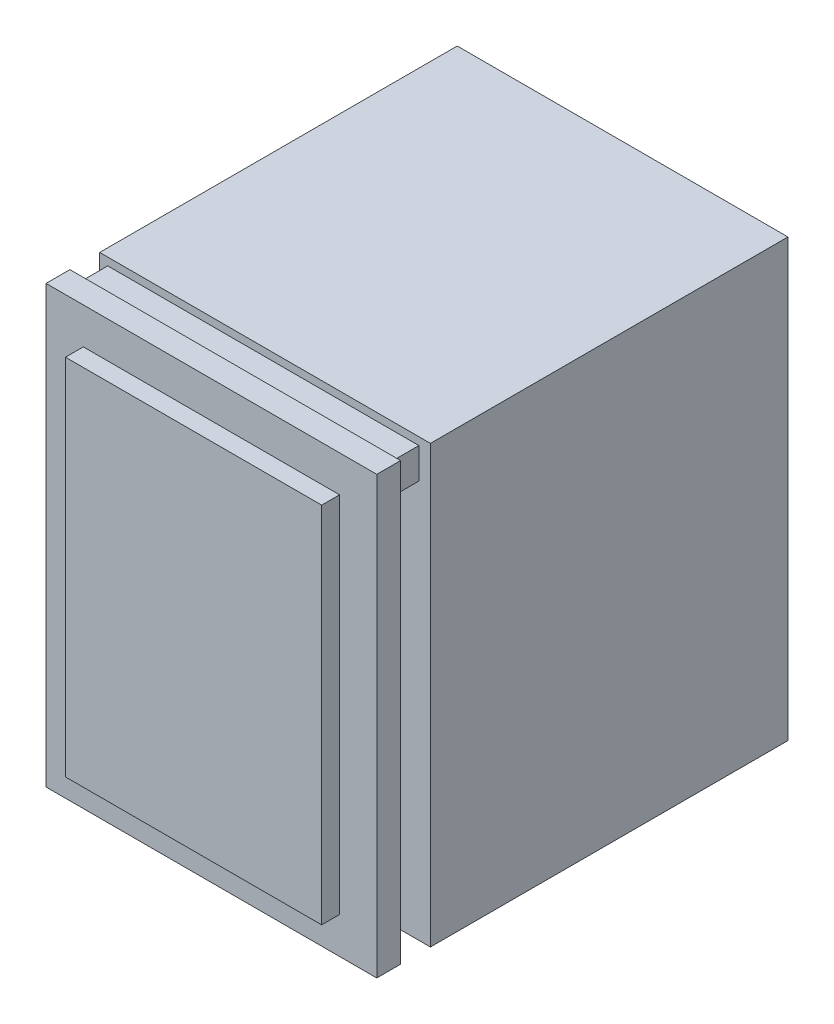
ISO-10303-21;
HEADER;
FILE_DESCRIPTION(('STEP AP214'),'2;1');
FILE_NAME('part.step','',(''),(''),'','','');
FILE_SCHEMA(('AUTOMOTIVE_DESIGN { 1 0 10303 214 1 1 1 1 }'));
ENDSEC;
DATA;
#1=APPLICATION_CONTEXT('core data for automotive mechanical design processes');
#2=APPLICATION_PROTOCOL_DEFINITION('international standard','automotive_design',2000,#1);
#3=PRODUCT_CONTEXT('',#1,'mechanical');
#4=PRODUCT('Part','Part','',(#3));
#5=PRODUCT_RELATED_PRODUCT_CATEGORY('part','',(#4));
#6=PRODUCT_DEFINITION_FORMATION('','',#4);
#7=PRODUCT_DEFINITION_CONTEXT('part definition',#1,'design');
#8=PRODUCT_DEFINITION('design','',#6,#7);
#9=PRODUCT_DEFINITION_SHAPE('','',#8);
#10=(LENGTH_UNIT() NAMED_UNIT(*) SI_UNIT(.MILLI.,.METRE.));
#11=(NAMED_UNIT(*) PLANE_ANGLE_UNIT() SI_UNIT($,.RADIAN.));
#12=(NAMED_UNIT(*) SI_UNIT($,.STERADIAN.) SOLID_ANGLE_UNIT());
#13=UNCERTAINTY_MEASURE_WITH_UNIT(LENGTH_MEASURE(1.E-05),#10,'distance_accuracy_value','');
#14=(GEOMETRIC_REPRESENTATION_CONTEXT(3) GLOBAL_UNCERTAINTY_ASSIGNED_CONTEXT((#13)) GLOBAL_UNIT_ASSIGNED_CONTEXT((#10,
#11,#12)) REPRESENTATION_CONTEXT('',''));
#15=CARTESIAN_POINT('',(0.,0.,0.));
#16=DIRECTION('',(0.,0.,1.));
#17=DIRECTION('',(1.,0.,0.));
#18=AXIS2_PLACEMENT_3D('',#15,#16,#17);
#19=CARTESIAN_POINT('',(0.,0.,4.));
#20=DIRECTION('',(0.,0.,-1.));
#21=DIRECTION('',(-1.,0.,0.));
#22=AXIS2_PLACEMENT_3D('',#19,#20,#21);
#23=PLANE('',#22);
#24=DIRECTION('',(0.,-1.,0.));
#25=VECTOR('',#24,1.);
#26=CARTESIAN_POINT('',(-27.75,36.6,4.));
#27=LINE('',#26,#25);
#28=CARTESIAN_POINT('',(-27.75,36.6,4.));
#29=VERTEX_POINT('',#28);
#30=CARTESIAN_POINT('',(-27.75,-36.6,4.));
#31=VERTEX_POINT('',#30);
#32=EDGE_CURVE('E235',#29,#31,#27,.T.);
#33=ORIENTED_EDGE('',*,*,#32,.T.);
#34=DIRECTION('',(1.,0.,0.));
#35=VECTOR('',#34,1.);
#36=CARTESIAN_POINT('',(27.75,-36.6,4.));
#37=LINE('',#36,#35);
#38=CARTESIAN_POINT('',(27.75,-36.6,4.));
#39=VERTEX_POINT('',#38);
#40=EDGE_CURVE('E238',#31,#39,#37,.T.);
#41=ORIENTED_EDGE('',*,*,#40,.T.);
#42=DIRECTION('',(0.,1.,0.));
#43=VECTOR('',#42,1.);
#44=CARTESIAN_POINT('',(27.75,36.6,4.));
#45=LINE('',#44,#43);
#46=CARTESIAN_POINT('',(27.75,36.6,4.));
#47=VERTEX_POINT('',#46);
#48=EDGE_CURVE('E241',#39,#47,#45,.T.);
#49=ORIENTED_EDGE('',*,*,#48,.T.);
#50=DIRECTION('',(-1.,0.,0.));
#51=VECTOR('',#50,1.);
#52=CARTESIAN_POINT('',(27.75,36.6,4.));
#53=LINE('',#52,#51);
#54=EDGE_CURVE('E243',#47,#29,#53,.T.);
#55=ORIENTED_EDGE('',*,*,#54,.T.);
#56=EDGE_LOOP('',(#33,#41,#49,#55));
#57=FACE_BOUND('',#56,.T.);
#58=DIRECTION('',(0.,-1.,0.));
#59=VECTOR('',#58,1.);
#60=CARTESIAN_POINT('',(-21.5,30.5,4.));
#61=LINE('',#60,#59);
#62=CARTESIAN_POINT('',(-21.5,30.5,4.));
#63=VERTEX_POINT('',#62);
#64=CARTESIAN_POINT('',(-21.5,-30.5,4.));
#65=VERTEX_POINT('',#64);
#66=EDGE_CURVE('E48',#63,#65,#61,.T.);
#67=ORIENTED_EDGE('',*,*,#66,.F.);
#68=DIRECTION('',(-1.,0.,0.));
#69=VECTOR('',#68,1.);
#70=CARTESIAN_POINT('',(21.5,30.5,4.));
#71=LINE('',#70,#69);
#72=CARTESIAN_POINT('',(21.5,30.5,4.));
#73=VERTEX_POINT('',#72);
#74=EDGE_CURVE('E52',#73,#63,#71,.T.);
#75=ORIENTED_EDGE('',*,*,#74,.F.);
#76=DIRECTION('',(0.,1.,0.));
#77=VECTOR('',#76,1.);
#78=CARTESIAN_POINT('',(21.5,30.5,4.));
#79=LINE('',#78,#77);
#80=CARTESIAN_POINT('',(21.5,-30.5,4.));
#81=VERTEX_POINT('',#80);
#82=EDGE_CURVE('E188',#81,#73,#79,.T.);
#83=ORIENTED_EDGE('',*,*,#82,.F.);
#84=DIRECTION('',(1.,0.,0.));
#85=VECTOR('',#84,1.);
#86=CARTESIAN_POINT('',(21.5,-30.5,4.));
#87=LINE('',#86,#85);
#88=EDGE_CURVE('E170',#65,#81,#87,.T.);
#89=ORIENTED_EDGE('',*,*,#88,.F.);
#90=EDGE_LOOP('',(#67,#75,#83,#89));
#91=FACE_BOUND('',#90,.T.);
#92=ADVANCED_FACE('F33',(#57,#91),#23,.F.);
#93=CARTESIAN_POINT('',(0.,0.,0.));
#94=DIRECTION('',(0.,0.,-1.));
#95=DIRECTION('',(-1.,0.,0.));
#96=AXIS2_PLACEMENT_3D('',#93,#94,#95);
#97=PLANE('',#96);
#98=DIRECTION('',(0.,-1.,0.));
#99=VECTOR('',#98,1.);
#100=CARTESIAN_POINT('',(-27.75,36.6,0.));
#101=LINE('',#100,#99);
#102=CARTESIAN_POINT('',(-27.75,36.6,0.));
#103=VERTEX_POINT('',#102);
#104=CARTESIAN_POINT('',(-27.75,-36.6,0.));
#105=VERTEX_POINT('',#104);
#106=EDGE_CURVE('E234',#103,#105,#101,.T.);
#107=ORIENTED_EDGE('',*,*,#106,.F.);
#108=DIRECTION('',(-1.,0.,0.));
#109=VECTOR('',#108,1.);
#110=CARTESIAN_POINT('',(27.75,36.6,0.));
#111=LINE('',#110,#109);
#112=CARTESIAN_POINT('',(27.75,36.6,0.));
#113=VERTEX_POINT('',#112);
#114=EDGE_CURVE('E239',#113,#103,#111,.T.);
#115=ORIENTED_EDGE('',*,*,#114,.F.);
#116=DIRECTION('',(0.,1.,0.));
#117=VECTOR('',#116,1.);
#118=CARTESIAN_POINT('',(27.75,36.6,0.));
#119=LINE('',#118,#117);
#120=CARTESIAN_POINT('',(27.75,-36.6,0.));
#121=VERTEX_POINT('',#120);
#122=EDGE_CURVE('E250',#121,#113,#119,.T.);
#123=ORIENTED_EDGE('',*,*,#122,.F.);
#124=DIRECTION('',(1.,0.,0.));
#125=VECTOR('',#124,1.);
#126=CARTESIAN_POINT('',(27.75,-36.6,0.));
#127=LINE('',#126,#125);
#128=EDGE_CURVE('E248',#105,#121,#127,.T.);
#129=ORIENTED_EDGE('',*,*,#128,.F.);
#130=EDGE_LOOP('',(#107,#115,#123,#129));
#131=FACE_BOUND('',#130,.T.);
#132=DIRECTION('',(-1.,0.,0.));
#133=VECTOR('',#132,1.);
#134=CARTESIAN_POINT('',(25.8177378410061,30.1531692897789,0.));
#135=LINE('',#134,#133);
#136=CARTESIAN_POINT('',(25.8177378410061,30.1531692897789,0.));
#137=VERTEX_POINT('',#136);
#138=CARTESIAN_POINT('',(-26.4022903958969,30.1531692897789,0.));
#139=VERTEX_POINT('',#138);
#140=EDGE_CURVE('E219',#137,#139,#135,.T.);
#141=ORIENTED_EDGE('',*,*,#140,.F.);
#142=DIRECTION('',(0.,-1.,0.));
#143=VECTOR('',#142,1.);
#144=CARTESIAN_POINT('',(25.8177378410061,35.3167168579801,0.));
#145=LINE('',#144,#143);
#146=CARTESIAN_POINT('',(25.8177378410061,35.3167168579801,0.));
#147=VERTEX_POINT('',#146);
#148=EDGE_CURVE('E202',#147,#137,#145,.T.);
#149=ORIENTED_EDGE('',*,*,#148,.F.);
#150=DIRECTION('',(1.,0.,0.));
#151=VECTOR('',#150,1.);
#152=CARTESIAN_POINT('',(25.8177378410061,35.3167168579801,0.));
#153=LINE('',#152,#151);
#154=CARTESIAN_POINT('',(-26.4022903958969,35.3167168579801,0.));
#155=VERTEX_POINT('',#154);
#156=EDGE_CURVE('E207',#155,#147,#153,.T.);
#157=ORIENTED_EDGE('',*,*,#156,.F.);
#158=DIRECTION('',(0.,1.,0.));
#159=VECTOR('',#158,1.);
#160=CARTESIAN_POINT('',(-26.4022903958969,35.3167168579801,0.));
#161=LINE('',#160,#159);
#162=EDGE_CURVE('E221',#139,#155,#161,.T.);
#163=ORIENTED_EDGE('',*,*,#162,.F.);
#164=EDGE_LOOP('',(#141,#149,#157,#163));
#165=FACE_BOUND('',#164,.T.);
#166=ADVANCED_FACE('F268',(#131,#165),#97,.T.);
#167=CARTESIAN_POINT('',(-27.75,36.6,4.));
#168=DIRECTION('',(1.,0.,0.));
#169=DIRECTION('',(0.,1.,0.));
#170=AXIS2_PLACEMENT_3D('',#167,#168,#169);
#171=PLANE('',#170);
#172=ORIENTED_EDGE('',*,*,#106,.T.);
#173=DIRECTION('',(0.,0.,-1.));
#174=VECTOR('',#173,1.);
#175=CARTESIAN_POINT('',(-27.75,-36.6,4.));
#176=LINE('',#175,#174);
#177=EDGE_CURVE('E11',#31,#105,#176,.T.);
#178=ORIENTED_EDGE('',*,*,#177,.F.);
#179=ORIENTED_EDGE('',*,*,#32,.F.);
#180=DIRECTION('',(0.,0.,-1.));
#181=VECTOR('',#180,1.);
#182=CARTESIAN_POINT('',(-27.75,36.6,4.));
#183=LINE('',#182,#181);
#184=EDGE_CURVE('E245',#29,#103,#183,.T.);
#185=ORIENTED_EDGE('',*,*,#184,.T.);
#186=EDGE_LOOP('',(#172,#178,#179,#185));
#187=FACE_BOUND('',#186,.T.);
#188=ADVANCED_FACE('F35',(#187),#171,.F.);
#189=CARTESIAN_POINT('',(27.75,-36.6,4.));
#190=DIRECTION('',(0.,1.,0.));
#191=DIRECTION('',(0.,0.,1.));
#192=AXIS2_PLACEMENT_3D('',#189,#190,#191);
#193=PLANE('',#192);
#194=ORIENTED_EDGE('',*,*,#128,.T.);
#195=DIRECTION('',(0.,0.,-1.));
#196=VECTOR('',#195,1.);
#197=CARTESIAN_POINT('',(27.75,-36.6,4.));
#198=LINE('',#197,#196);
#199=EDGE_CURVE('E41',#39,#121,#198,.T.);
#200=ORIENTED_EDGE('',*,*,#199,.F.);
#201=ORIENTED_EDGE('',*,*,#40,.F.);
#202=ORIENTED_EDGE('',*,*,#177,.T.);
#203=EDGE_LOOP('',(#194,#200,#201,#202));
#204=FACE_BOUND('',#203,.T.);
#205=ADVANCED_FACE('F278',(#204),#193,.F.);
#206=CARTESIAN_POINT('',(27.75,36.6,4.));
#207=DIRECTION('',(-1.,0.,0.));
#208=DIRECTION('',(0.,-1.,0.));
#209=AXIS2_PLACEMENT_3D('',#206,#207,#208);
#210=PLANE('',#209);
#211=ORIENTED_EDGE('',*,*,#122,.T.);
#212=DIRECTION('',(0.,0.,-1.));
#213=VECTOR('',#212,1.);
#214=CARTESIAN_POINT('',(27.75,36.6,4.));
#215=LINE('',#214,#213);
#216=EDGE_CURVE('E255',#47,#113,#215,.T.);
#217=ORIENTED_EDGE('',*,*,#216,.F.);
#218=ORIENTED_EDGE('',*,*,#48,.F.);
#219=ORIENTED_EDGE('',*,*,#199,.T.);
#220=EDGE_LOOP('',(#211,#217,#218,#219));
#221=FACE_BOUND('',#220,.T.);
#222=ADVANCED_FACE('F262',(#221),#210,.F.);
#223=CARTESIAN_POINT('',(27.75,36.6,4.));
#224=DIRECTION('',(0.,-1.,0.));
#225=DIRECTION('',(0.,0.,-1.));
#226=AXIS2_PLACEMENT_3D('',#223,#224,#225);
#227=PLANE('',#226);
#228=ORIENTED_EDGE('',*,*,#114,.T.);
#229=ORIENTED_EDGE('',*,*,#184,.F.);
#230=ORIENTED_EDGE('',*,*,#54,.F.);
#231=ORIENTED_EDGE('',*,*,#216,.T.);
#232=EDGE_LOOP('',(#228,#229,#230,#231));
#233=FACE_BOUND('',#232,.T.);
#234=ADVANCED_FACE('F272',(#233),#227,.F.);
#235=CARTESIAN_POINT('',(25.8177378410061,35.3167168579801,-5.));
#236=DIRECTION('',(-1.,0.,0.));
#237=DIRECTION('',(0.,0.,1.));
#238=AXIS2_PLACEMENT_3D('',#235,#236,#237);
#239=PLANE('',#238);
#240=ORIENTED_EDGE('',*,*,#148,.T.);
#241=DIRECTION('',(0.,0.,1.));
#242=VECTOR('',#241,1.);
#243=CARTESIAN_POINT('',(25.8177378410061,30.1531692897789,-5.));
#244=LINE('',#243,#242);
#245=CARTESIAN_POINT('',(25.8177378410061,30.1531692897789,-5.));
#246=VERTEX_POINT('',#245);
#247=EDGE_CURVE('E232',#246,#137,#244,.T.);
#248=ORIENTED_EDGE('',*,*,#247,.F.);
#249=DIRECTION('',(0.,-1.,0.));
#250=VECTOR('',#249,1.);
#251=CARTESIAN_POINT('',(25.8177378410061,35.3167168579801,-5.));
#252=LINE('',#251,#250);
#253=CARTESIAN_POINT('',(25.8177378410061,35.3167168579801,-5.));
#254=VERTEX_POINT('',#253);
#255=EDGE_CURVE('E203',#254,#246,#252,.T.);
#256=ORIENTED_EDGE('',*,*,#255,.F.);
#257=DIRECTION('',(0.,0.,1.));
#258=VECTOR('',#257,1.);
#259=CARTESIAN_POINT('',(25.8177378410061,35.3167168579801,-5.));
#260=LINE('',#259,#258);
#261=EDGE_CURVE('E216',#254,#147,#260,.T.);
#262=ORIENTED_EDGE('',*,*,#261,.T.);
#263=EDGE_LOOP('',(#240,#248,#256,#262));
#264=FACE_BOUND('',#263,.T.);
#265=ADVANCED_FACE('F292',(#264),#239,.F.);
#266=CARTESIAN_POINT('',(25.8177378410061,30.1531692897789,-5.));
#267=DIRECTION('',(0.,1.,0.));
#268=DIRECTION('',(0.,0.,1.));
#269=AXIS2_PLACEMENT_3D('',#266,#267,#268);
#270=PLANE('',#269);
#271=ORIENTED_EDGE('',*,*,#140,.T.);
#272=DIRECTION('',(0.,0.,1.));
#273=VECTOR('',#272,1.);
#274=CARTESIAN_POINT('',(-26.4022903958969,30.1531692897789,-5.));
#275=LINE('',#274,#273);
#276=CARTESIAN_POINT('',(-26.4022903958969,30.1531692897789,-5.));
#277=VERTEX_POINT('',#276);
#278=EDGE_CURVE('E229',#277,#139,#275,.T.);
#279=ORIENTED_EDGE('',*,*,#278,.F.);
#280=DIRECTION('',(-1.,0.,0.));
#281=VECTOR('',#280,1.);
#282=CARTESIAN_POINT('',(25.8177378410061,30.1531692897789,-5.));
#283=LINE('',#282,#281);
#284=EDGE_CURVE('E206',#246,#277,#283,.T.);
#285=ORIENTED_EDGE('',*,*,#284,.F.);
#286=ORIENTED_EDGE('',*,*,#247,.T.);
#287=EDGE_LOOP('',(#271,#279,#285,#286));
#288=FACE_BOUND('',#287,.T.);
#289=ADVANCED_FACE('F300',(#288),#270,.F.);
#290=CARTESIAN_POINT('',(-26.4022903958969,35.3167168579801,-5.));
#291=DIRECTION('',(1.,0.,0.));
#292=DIRECTION('',(0.,0.,-1.));
#293=AXIS2_PLACEMENT_3D('',#290,#291,#292);
#294=PLANE('',#293);
#295=ORIENTED_EDGE('',*,*,#162,.T.);
#296=DIRECTION('',(0.,0.,1.));
#297=VECTOR('',#296,1.);
#298=CARTESIAN_POINT('',(-26.4022903958969,35.3167168579801,-5.));
#299=LINE('',#298,#297);
#300=CARTESIAN_POINT('',(-26.4022903958969,35.3167168579801,-5.));
#301=VERTEX_POINT('',#300);
#302=EDGE_CURVE('E227',#301,#155,#299,.T.);
#303=ORIENTED_EDGE('',*,*,#302,.F.);
#304=DIRECTION('',(0.,1.,0.));
#305=VECTOR('',#304,1.);
#306=CARTESIAN_POINT('',(-26.4022903958969,35.3167168579801,-5.));
#307=LINE('',#306,#305);
#308=EDGE_CURVE('E210',#277,#301,#307,.T.);
#309=ORIENTED_EDGE('',*,*,#308,.F.);
#310=ORIENTED_EDGE('',*,*,#278,.T.);
#311=EDGE_LOOP('',(#295,#303,#309,#310));
#312=FACE_BOUND('',#311,.T.);
#313=ADVANCED_FACE('F305',(#312),#294,.F.);
#314=CARTESIAN_POINT('',(25.8177378410061,35.3167168579801,-5.));
#315=DIRECTION('',(0.,-1.,0.));
#316=DIRECTION('',(0.,0.,-1.));
#317=AXIS2_PLACEMENT_3D('',#314,#315,#316);
#318=PLANE('',#317);
#319=ORIENTED_EDGE('',*,*,#156,.T.);
#320=ORIENTED_EDGE('',*,*,#261,.F.);
#321=DIRECTION('',(1.,0.,0.));
#322=VECTOR('',#321,1.);
#323=CARTESIAN_POINT('',(25.8177378410061,35.3167168579801,-5.));
#324=LINE('',#323,#322);
#325=EDGE_CURVE('E213',#301,#254,#324,.T.);
#326=ORIENTED_EDGE('',*,*,#325,.F.);
#327=ORIENTED_EDGE('',*,*,#302,.T.);
#328=EDGE_LOOP('',(#319,#320,#326,#327));
#329=FACE_BOUND('',#328,.T.);
#330=ADVANCED_FACE('F319',(#329),#318,.F.);
#331=CARTESIAN_POINT('',(-21.5,30.5,7.));
#332=DIRECTION('',(1.,0.,0.));
#333=DIRECTION('',(0.,1.,0.));
#334=AXIS2_PLACEMENT_3D('',#331,#332,#333);
#335=PLANE('',#334);
#336=ORIENTED_EDGE('',*,*,#66,.T.);
#337=DIRECTION('',(0.,0.,-1.));
#338=VECTOR('',#337,1.);
#339=CARTESIAN_POINT('',(-21.5,-30.5,7.));
#340=LINE('',#339,#338);
#341=CARTESIAN_POINT('',(-21.5,-30.5,7.));
#342=VERTEX_POINT('',#341);
#343=EDGE_CURVE('E199',#342,#65,#340,.T.);
#344=ORIENTED_EDGE('',*,*,#343,.F.);
#345=DIRECTION('',(0.,-1.,0.));
#346=VECTOR('',#345,1.);
#347=CARTESIAN_POINT('',(-21.5,30.5,7.));
#348=LINE('',#347,#346);
#349=CARTESIAN_POINT('',(-21.5,30.5,7.));
#350=VERTEX_POINT('',#349);
#351=EDGE_CURVE('E176',#350,#342,#348,.T.);
#352=ORIENTED_EDGE('',*,*,#351,.F.);
#353=DIRECTION('',(0.,0.,-1.));
#354=VECTOR('',#353,1.);
#355=CARTESIAN_POINT('',(-21.5,30.5,7.));
#356=LINE('',#355,#354);
#357=EDGE_CURVE('E184',#350,#63,#356,.T.);
#358=ORIENTED_EDGE('',*,*,#357,.T.);
#359=EDGE_LOOP('',(#336,#344,#352,#358));
#360=FACE_BOUND('',#359,.T.);
#361=ADVANCED_FACE('F321',(#360),#335,.F.);
#362=CARTESIAN_POINT('',(21.5,-30.5,7.));
#363=DIRECTION('',(0.,1.,0.));
#364=DIRECTION('',(-1.,0.,0.));
#365=AXIS2_PLACEMENT_3D('',#362,#363,#364);
#366=PLANE('',#365);
#367=ORIENTED_EDGE('',*,*,#88,.T.);
#368=DIRECTION('',(0.,0.,-1.));
#369=VECTOR('',#368,1.);
#370=CARTESIAN_POINT('',(21.5,-30.5,7.));
#371=LINE('',#370,#369);
#372=CARTESIAN_POINT('',(21.5,-30.5,7.));
#373=VERTEX_POINT('',#372);
#374=EDGE_CURVE('E196',#373,#81,#371,.T.);
#375=ORIENTED_EDGE('',*,*,#374,.F.);
#376=DIRECTION('',(1.,0.,0.));
#377=VECTOR('',#376,1.);
#378=CARTESIAN_POINT('',(21.5,-30.5,7.));
#379=LINE('',#378,#377);
#380=EDGE_CURVE('E179',#342,#373,#379,.T.);
#381=ORIENTED_EDGE('',*,*,#380,.F.);
#382=ORIENTED_EDGE('',*,*,#343,.T.);
#383=EDGE_LOOP('',(#367,#375,#381,#382));
#384=FACE_BOUND('',#383,.T.);
#385=ADVANCED_FACE('F328',(#384),#366,.F.);
#386=CARTESIAN_POINT('',(21.5,30.5,7.));
#387=DIRECTION('',(-1.,0.,0.));
#388=DIRECTION('',(0.,-1.,0.));
#389=AXIS2_PLACEMENT_3D('',#386,#387,#388);
#390=PLANE('',#389);
#391=ORIENTED_EDGE('',*,*,#82,.T.);
#392=DIRECTION('',(0.,0.,-1.));
#393=VECTOR('',#392,1.);
#394=CARTESIAN_POINT('',(21.5,30.5,7.));
#395=LINE('',#394,#393);
#396=CARTESIAN_POINT('',(21.5,30.5,7.));
#397=VERTEX_POINT('',#396);
#398=EDGE_CURVE('E193',#397,#73,#395,.T.);
#399=ORIENTED_EDGE('',*,*,#398,.F.);
#400=DIRECTION('',(0.,1.,0.));
#401=VECTOR('',#400,1.);
#402=CARTESIAN_POINT('',(21.5,30.5,7.));
#403=LINE('',#402,#401);
#404=EDGE_CURVE('E181',#373,#397,#403,.T.);
#405=ORIENTED_EDGE('',*,*,#404,.F.);
#406=ORIENTED_EDGE('',*,*,#374,.T.);
#407=EDGE_LOOP('',(#391,#399,#405,#406));
#408=FACE_BOUND('',#407,.T.);
#409=ADVANCED_FACE('F335',(#408),#390,.F.);
#410=CARTESIAN_POINT('',(21.5,30.5,7.));
#411=DIRECTION('',(0.,-1.,0.));
#412=DIRECTION('',(1.,0.,0.));
#413=AXIS2_PLACEMENT_3D('',#410,#411,#412);
#414=PLANE('',#413);
#415=ORIENTED_EDGE('',*,*,#74,.T.);
#416=ORIENTED_EDGE('',*,*,#357,.F.);
#417=DIRECTION('',(-1.,0.,0.));
#418=VECTOR('',#417,1.);
#419=CARTESIAN_POINT('',(21.5,30.5,7.));
#420=LINE('',#419,#418);
#421=EDGE_CURVE('E183',#397,#350,#420,.T.);
#422=ORIENTED_EDGE('',*,*,#421,.F.);
#423=ORIENTED_EDGE('',*,*,#398,.T.);
#424=EDGE_LOOP('',(#415,#416,#422,#423));
#425=FACE_BOUND('',#424,.T.);
#426=ADVANCED_FACE('F339',(#425),#414,.F.);
#427=CARTESIAN_POINT('',(0.,0.,7.));
#428=DIRECTION('',(0.,0.,-1.));
#429=DIRECTION('',(-1.,0.,0.));
#430=AXIS2_PLACEMENT_3D('',#427,#428,#429);
#431=PLANE('',#430);
#432=ORIENTED_EDGE('',*,*,#351,.T.);
#433=ORIENTED_EDGE('',*,*,#380,.T.);
#434=ORIENTED_EDGE('',*,*,#404,.T.);
#435=ORIENTED_EDGE('',*,*,#421,.T.);
#436=EDGE_LOOP('',(#432,#433,#434,#435));
#437=FACE_BOUND('',#436,.T.);
#438=ADVANCED_FACE('F343',(#437),#431,.F.);
#439=CARTESIAN_POINT('',(0.,0.,-5.));
#440=DIRECTION('',(0.,0.,-1.));
#441=DIRECTION('',(-1.,0.,0.));
#442=AXIS2_PLACEMENT_3D('',#439,#440,#441);
#443=PLANE('',#442);
#444=DIRECTION('',(-1.,0.,0.));
#445=VECTOR('',#444,1.);
#446=CARTESIAN_POINT('',(27.75,-36.6,-5.));
#447=LINE('',#446,#445);
#448=CARTESIAN_POINT('',(27.75,-36.6,-5.));
#449=VERTEX_POINT('',#448);
#450=CARTESIAN_POINT('',(-27.75,-36.6,-5.));
#451=VERTEX_POINT('',#450);
#452=EDGE_CURVE('E168',#449,#451,#447,.T.);
#453=ORIENTED_EDGE('',*,*,#452,.F.);
#454=DIRECTION('',(0.,-1.,0.));
#455=VECTOR('',#454,1.);
#456=CARTESIAN_POINT('',(27.75,36.6,-5.));
#457=LINE('',#456,#455);
#458=CARTESIAN_POINT('',(27.75,36.6,-5.));
#459=VERTEX_POINT('',#458);
#460=EDGE_CURVE('E164',#459,#449,#457,.T.);
#461=ORIENTED_EDGE('',*,*,#460,.F.);
#462=DIRECTION('',(1.,0.,0.));
#463=VECTOR('',#462,1.);
#464=CARTESIAN_POINT('',(-27.75,36.6,-5.));
#465=LINE('',#464,#463);
#466=CARTESIAN_POINT('',(-27.75,36.6,-5.));
#467=VERTEX_POINT('',#466);
#468=EDGE_CURVE('E482',#467,#459,#465,.T.);
#469=ORIENTED_EDGE('',*,*,#468,.F.);
#470=DIRECTION('',(0.,1.,0.));
#471=VECTOR('',#470,1.);
#472=CARTESIAN_POINT('',(-27.75,-36.6,-5.));
#473=LINE('',#472,#471);
#474=EDGE_CURVE('E480',#451,#467,#473,.T.);
#475=ORIENTED_EDGE('',*,*,#474,.F.);
#476=EDGE_LOOP('',(#453,#461,#469,#475));
#477=FACE_BOUND('',#476,.T.);
#478=ORIENTED_EDGE('',*,*,#325,.T.);
#479=ORIENTED_EDGE('',*,*,#255,.T.);
#480=ORIENTED_EDGE('',*,*,#284,.T.);
#481=ORIENTED_EDGE('',*,*,#308,.T.);
#482=EDGE_LOOP('',(#478,#479,#480,#481));
#483=FACE_BOUND('',#482,.T.);
#484=ADVANCED_FACE('F317',(#477,#483),#443,.F.);
#485=CARTESIAN_POINT('',(27.75,-36.6,-65.));
#486=DIRECTION('',(0.,1.,0.));
#487=DIRECTION('',(0.,0.,1.));
#488=AXIS2_PLACEMENT_3D('',#485,#486,#487);
#489=PLANE('',#488);
#490=ORIENTED_EDGE('',*,*,#452,.T.);
#491=DIRECTION('',(0.,0.,1.));
#492=VECTOR('',#491,1.);
#493=CARTESIAN_POINT('',(-27.75,-36.6,-65.));
#494=LINE('',#493,#492);
#495=CARTESIAN_POINT('',(-27.75,-36.6,-65.));
#496=VERTEX_POINT('',#495);
#497=EDGE_CURVE('E148',#496,#451,#494,.T.);
#498=ORIENTED_EDGE('',*,*,#497,.F.);
#499=DIRECTION('',(-1.,0.,0.));
#500=VECTOR('',#499,1.);
#501=CARTESIAN_POINT('',(27.75,-36.6,-65.));
#502=LINE('',#501,#500);
#503=CARTESIAN_POINT('',(27.75,-36.6,-65.));
#504=VERTEX_POINT('',#503);
#505=EDGE_CURVE('E155',#504,#496,#502,.T.);
#506=ORIENTED_EDGE('',*,*,#505,.F.);
#507=DIRECTION('',(0.,0.,1.));
#508=VECTOR('',#507,1.);
#509=CARTESIAN_POINT('',(27.75,-36.6,-65.));
#510=LINE('',#509,#508);
#511=EDGE_CURVE('E489',#504,#449,#510,.T.);
#512=ORIENTED_EDGE('',*,*,#511,.T.);
#513=EDGE_LOOP('',(#490,#498,#506,#512));
#514=FACE_BOUND('',#513,.T.);
#515=ADVANCED_FACE('F166',(#514),#489,.F.);
#516=CARTESIAN_POINT('',(-27.75,-36.6,-65.));
#517=DIRECTION('',(1.,0.,0.));
#518=DIRECTION('',(0.,1.,0.));
#519=AXIS2_PLACEMENT_3D('',#516,#517,#518);
#520=PLANE('',#519);
#521=ORIENTED_EDGE('',*,*,#474,.T.);
#522=DIRECTION('',(0.,0.,1.));
#523=VECTOR('',#522,1.);
#524=CARTESIAN_POINT('',(-27.75,36.6,-65.));
#525=LINE('',#524,#523);
#526=CARTESIAN_POINT('',(-27.75,36.6,-65.));
#527=VERTEX_POINT('',#526);
#528=EDGE_CURVE('E151',#527,#467,#525,.T.);
#529=ORIENTED_EDGE('',*,*,#528,.F.);
#530=DIRECTION('',(0.,1.,0.));
#531=VECTOR('',#530,1.);
#532=CARTESIAN_POINT('',(-27.75,-36.6,-65.));
#533=LINE('',#532,#531);
#534=EDGE_CURVE('E144',#496,#527,#533,.T.);
#535=ORIENTED_EDGE('',*,*,#534,.F.);
#536=ORIENTED_EDGE('',*,*,#497,.T.);
#537=EDGE_LOOP('',(#521,#529,#535,#536));
#538=FACE_BOUND('',#537,.T.);
#539=ADVANCED_FACE('F146',(#538),#520,.F.);
#540=CARTESIAN_POINT('',(-27.75,36.6,-65.));
#541=DIRECTION('',(0.,-1.,0.));
#542=DIRECTION('',(0.,0.,-1.));
#543=AXIS2_PLACEMENT_3D('',#540,#541,#542);
#544=PLANE('',#543);
#545=ORIENTED_EDGE('',*,*,#468,.T.);
#546=DIRECTION('',(0.,0.,1.));
#547=VECTOR('',#546,1.);
#548=CARTESIAN_POINT('',(27.75,36.6,-65.));
#549=LINE('',#548,#547);
#550=CARTESIAN_POINT('',(27.75,36.6,-65.));
#551=VERTEX_POINT('',#550);
#552=EDGE_CURVE('E172',#551,#459,#549,.T.);
#553=ORIENTED_EDGE('',*,*,#552,.F.);
#554=DIRECTION('',(1.,0.,0.));
#555=VECTOR('',#554,1.);
#556=CARTESIAN_POINT('',(-27.75,36.6,-65.));
#557=LINE('',#556,#555);
#558=EDGE_CURVE('E154',#527,#551,#557,.T.);
#559=ORIENTED_EDGE('',*,*,#558,.F.);
#560=ORIENTED_EDGE('',*,*,#528,.T.);
#561=EDGE_LOOP('',(#545,#553,#559,#560));
#562=FACE_BOUND('',#561,.T.);
#563=ADVANCED_FACE('F352',(#562),#544,.F.);
#564=CARTESIAN_POINT('',(27.75,36.6,-65.));
#565=DIRECTION('',(-1.,0.,0.));
#566=DIRECTION('',(0.,-1.,0.));
#567=AXIS2_PLACEMENT_3D('',#564,#565,#566);
#568=PLANE('',#567);
#569=ORIENTED_EDGE('',*,*,#460,.T.);
#570=ORIENTED_EDGE('',*,*,#511,.F.);
#571=DIRECTION('',(0.,-1.,0.));
#572=VECTOR('',#571,1.);
#573=CARTESIAN_POINT('',(27.75,36.6,-65.));
#574=LINE('',#573,#572);
#575=EDGE_CURVE('E160',#551,#504,#574,.T.);
#576=ORIENTED_EDGE('',*,*,#575,.F.);
#577=ORIENTED_EDGE('',*,*,#552,.T.);
#578=EDGE_LOOP('',(#569,#570,#576,#577));
#579=FACE_BOUND('',#578,.T.);
#580=ADVANCED_FACE('F355',(#579),#568,.F.);
#581=CARTESIAN_POINT('',(0.,0.,-65.));
#582=DIRECTION('',(0.,0.,-1.));
#583=DIRECTION('',(-1.,0.,0.));
#584=AXIS2_PLACEMENT_3D('',#581,#582,#583);
#585=PLANE('',#584);
#586=ORIENTED_EDGE('',*,*,#505,.T.);
#587=ORIENTED_EDGE('',*,*,#534,.T.);
#588=ORIENTED_EDGE('',*,*,#558,.T.);
#589=ORIENTED_EDGE('',*,*,#575,.T.);
#590=EDGE_LOOP('',(#586,#587,#588,#589));
#591=FACE_BOUND('',#590,.T.);
#592=ADVANCED_FACE('F158',(#591),#585,.T.);
#593=CLOSED_SHELL('',(#92,#166,#188,#205,#222,#234,#265,#289,#313,#330,#361,#385,#409,#426,#438,
#484,#515,#539,#563,#580,#592));
#594=MANIFOLD_SOLID_BREP('B2',#593);
#595=ADVANCED_BREP_SHAPE_REPRESENTATION('',(#18,#594),#14);
#596=SHAPE_DEFINITION_REPRESENTATION(#9,#595);
ENDSEC;
END-ISO-10303-21;
